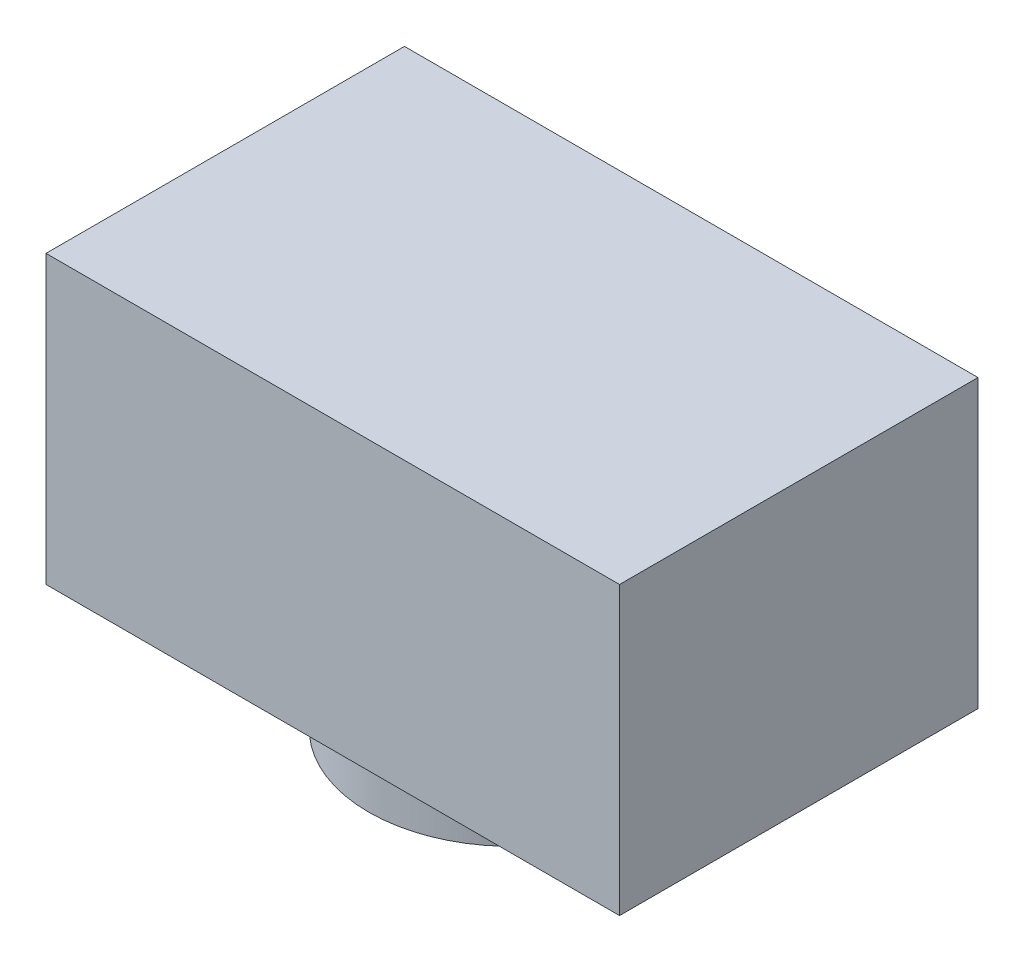
ISO-10303-21;
HEADER;
FILE_DESCRIPTION(('STEP AP214'),'2;1');
FILE_NAME('part.step','',(''),(''),'','','');
FILE_SCHEMA(('AUTOMOTIVE_DESIGN { 1 0 10303 214 1 1 1 1 }'));
ENDSEC;
DATA;
#1=APPLICATION_CONTEXT('core data for automotive mechanical design processes');
#2=APPLICATION_PROTOCOL_DEFINITION('international standard','automotive_design',2000,#1);
#3=PRODUCT_CONTEXT('',#1,'mechanical');
#4=PRODUCT('Part','Part','',(#3));
#5=PRODUCT_RELATED_PRODUCT_CATEGORY('part','',(#4));
#6=PRODUCT_DEFINITION_FORMATION('','',#4);
#7=PRODUCT_DEFINITION_CONTEXT('part definition',#1,'design');
#8=PRODUCT_DEFINITION('design','',#6,#7);
#9=PRODUCT_DEFINITION_SHAPE('','',#8);
#10=(LENGTH_UNIT() NAMED_UNIT(*) SI_UNIT(.MILLI.,.METRE.));
#11=(NAMED_UNIT(*) PLANE_ANGLE_UNIT() SI_UNIT($,.RADIAN.));
#12=(NAMED_UNIT(*) SI_UNIT($,.STERADIAN.) SOLID_ANGLE_UNIT());
#13=UNCERTAINTY_MEASURE_WITH_UNIT(LENGTH_MEASURE(1.E-05),#10,'distance_accuracy_value','');
#14=(GEOMETRIC_REPRESENTATION_CONTEXT(3) GLOBAL_UNCERTAINTY_ASSIGNED_CONTEXT((#13)) GLOBAL_UNIT_ASSIGNED_CONTEXT((#10,
#11,#12)) REPRESENTATION_CONTEXT('',''));
#15=CARTESIAN_POINT('',(0.,0.,0.));
#16=DIRECTION('',(0.,0.,1.));
#17=DIRECTION('',(1.,0.,0.));
#18=AXIS2_PLACEMENT_3D('',#15,#16,#17);
#19=CARTESIAN_POINT('',(-4.,2.,5.));
#20=DIRECTION('',(1.,0.,0.));
#21=DIRECTION('',(0.,0.,-1.));
#22=AXIS2_PLACEMENT_3D('',#19,#20,#21);
#23=PLANE('',#22);
#24=DIRECTION('',(0.,-1.,0.));
#25=VECTOR('',#24,1.);
#26=CARTESIAN_POINT('',(-4.,2.,0.));
#27=LINE('',#26,#25);
#28=CARTESIAN_POINT('',(-4.,2.,0.));
#29=VERTEX_POINT('',#28);
#30=CARTESIAN_POINT('',(-4.,-2.,0.));
#31=VERTEX_POINT('',#30);
#32=EDGE_CURVE('E100',#29,#31,#27,.T.);
#33=ORIENTED_EDGE('',*,*,#32,.T.);
#34=DIRECTION('',(0.,0.,-1.));
#35=VECTOR('',#34,1.);
#36=CARTESIAN_POINT('',(-4.,-2.,5.));
#37=LINE('',#36,#35);
#38=CARTESIAN_POINT('',(-4.,-2.,5.));
#39=VERTEX_POINT('',#38);
#40=EDGE_CURVE('E37',#39,#31,#37,.T.);
#41=ORIENTED_EDGE('',*,*,#40,.F.);
#42=DIRECTION('',(0.,-1.,0.));
#43=VECTOR('',#42,1.);
#44=CARTESIAN_POINT('',(-4.,2.,5.));
#45=LINE('',#44,#43);
#46=CARTESIAN_POINT('',(-4.,2.,5.));
#47=VERTEX_POINT('',#46);
#48=EDGE_CURVE('E85',#47,#39,#45,.T.);
#49=ORIENTED_EDGE('',*,*,#48,.F.);
#50=DIRECTION('',(0.,0.,-1.));
#51=VECTOR('',#50,1.);
#52=CARTESIAN_POINT('',(-4.,2.,5.));
#53=LINE('',#52,#51);
#54=EDGE_CURVE('E51',#47,#29,#53,.T.);
#55=ORIENTED_EDGE('',*,*,#54,.T.);
#56=EDGE_LOOP('',(#33,#41,#49,#55));
#57=FACE_BOUND('',#56,.T.);
#58=ADVANCED_FACE('F34',(#57),#23,.F.);
#59=CARTESIAN_POINT('',(-4.,-2.,5.));
#60=DIRECTION('',(0.,1.,0.));
#61=DIRECTION('',(0.,0.,1.));
#62=AXIS2_PLACEMENT_3D('',#59,#60,#61);
#63=PLANE('',#62);
#64=CARTESIAN_POINT('',(0.,-2.,2.5));
#65=DIRECTION('',(0.,-1.,0.));
#66=DIRECTION('',(0.,0.,-1.));
#67=AXIS2_PLACEMENT_3D('',#64,#65,#66);
#68=CIRCLE('',#67,2.);
#69=CARTESIAN_POINT('',(0.,-2.,0.5));
#70=VERTEX_POINT('',#69);
#71=EDGE_CURVE('E11',#70,#70,#68,.T.);
#72=ORIENTED_EDGE('',*,*,#71,.F.);
#73=EDGE_LOOP('',(#72));
#74=FACE_BOUND('',#73,.T.);
#75=DIRECTION('',(1.,0.,0.));
#76=VECTOR('',#75,1.);
#77=CARTESIAN_POINT('',(-4.,-2.,0.));
#78=LINE('',#77,#76);
#79=CARTESIAN_POINT('',(4.,-2.,0.));
#80=VERTEX_POINT('',#79);
#81=EDGE_CURVE('E91',#31,#80,#78,.T.);
#82=ORIENTED_EDGE('',*,*,#81,.T.);
#83=DIRECTION('',(0.,0.,-1.));
#84=VECTOR('',#83,1.);
#85=CARTESIAN_POINT('',(4.,-2.,5.));
#86=LINE('',#85,#84);
#87=CARTESIAN_POINT('',(4.,-2.,5.));
#88=VERTEX_POINT('',#87);
#89=EDGE_CURVE('E89',#88,#80,#86,.T.);
#90=ORIENTED_EDGE('',*,*,#89,.F.);
#91=DIRECTION('',(1.,0.,0.));
#92=VECTOR('',#91,1.);
#93=CARTESIAN_POINT('',(-4.,-2.,5.));
#94=LINE('',#93,#92);
#95=EDGE_CURVE('E77',#39,#88,#94,.T.);
#96=ORIENTED_EDGE('',*,*,#95,.F.);
#97=ORIENTED_EDGE('',*,*,#40,.T.);
#98=EDGE_LOOP('',(#82,#90,#96,#97));
#99=FACE_BOUND('',#98,.T.);
#100=ADVANCED_FACE('F90',(#74,#99),#63,.F.);
#101=CARTESIAN_POINT('',(4.,2.,5.));
#102=DIRECTION('',(1.,0.,0.));
#103=DIRECTION('',(0.,0.,-1.));
#104=AXIS2_PLACEMENT_3D('',#101,#102,#103);
#105=PLANE('',#104);
#106=DIRECTION('',(0.,-1.,0.));
#107=VECTOR('',#106,1.);
#108=CARTESIAN_POINT('',(4.,2.,0.));
#109=LINE('',#108,#107);
#110=CARTESIAN_POINT('',(4.,2.,0.));
#111=VERTEX_POINT('',#110);
#112=EDGE_CURVE('E104',#111,#80,#109,.T.);
#113=ORIENTED_EDGE('',*,*,#112,.F.);
#114=DIRECTION('',(0.,0.,-1.));
#115=VECTOR('',#114,1.);
#116=CARTESIAN_POINT('',(4.,2.,5.));
#117=LINE('',#116,#115);
#118=CARTESIAN_POINT('',(4.,2.,5.));
#119=VERTEX_POINT('',#118);
#120=EDGE_CURVE('E65',#119,#111,#117,.T.);
#121=ORIENTED_EDGE('',*,*,#120,.F.);
#122=DIRECTION('',(0.,-1.,0.));
#123=VECTOR('',#122,1.);
#124=CARTESIAN_POINT('',(4.,2.,5.));
#125=LINE('',#124,#123);
#126=EDGE_CURVE('E84',#119,#88,#125,.T.);
#127=ORIENTED_EDGE('',*,*,#126,.T.);
#128=ORIENTED_EDGE('',*,*,#89,.T.);
#129=EDGE_LOOP('',(#113,#121,#127,#128));
#130=FACE_BOUND('',#129,.T.);
#131=ADVANCED_FACE('F94',(#130),#105,.T.);
#132=CARTESIAN_POINT('',(-4.,2.,5.));
#133=DIRECTION('',(0.,1.,0.));
#134=DIRECTION('',(-1.,0.,0.));
#135=AXIS2_PLACEMENT_3D('',#132,#133,#134);
#136=PLANE('',#135);
#137=DIRECTION('',(1.,0.,0.));
#138=VECTOR('',#137,1.);
#139=CARTESIAN_POINT('',(-4.,2.,0.));
#140=LINE('',#139,#138);
#141=EDGE_CURVE('E106',#29,#111,#140,.T.);
#142=ORIENTED_EDGE('',*,*,#141,.F.);
#143=ORIENTED_EDGE('',*,*,#54,.F.);
#144=DIRECTION('',(1.,0.,0.));
#145=VECTOR('',#144,1.);
#146=CARTESIAN_POINT('',(-4.,2.,5.));
#147=LINE('',#146,#145);
#148=EDGE_CURVE('E95',#47,#119,#147,.T.);
#149=ORIENTED_EDGE('',*,*,#148,.T.);
#150=ORIENTED_EDGE('',*,*,#120,.T.);
#151=EDGE_LOOP('',(#142,#143,#149,#150));
#152=FACE_BOUND('',#151,.T.);
#153=ADVANCED_FACE('F147',(#152),#136,.T.);
#154=CARTESIAN_POINT('',(0.,0.,5.));
#155=DIRECTION('',(0.,0.,1.));
#156=DIRECTION('',(1.,0.,0.));
#157=AXIS2_PLACEMENT_3D('',#154,#155,#156);
#158=PLANE('',#157);
#159=ORIENTED_EDGE('',*,*,#48,.T.);
#160=ORIENTED_EDGE('',*,*,#95,.T.);
#161=ORIENTED_EDGE('',*,*,#126,.F.);
#162=ORIENTED_EDGE('',*,*,#148,.F.);
#163=EDGE_LOOP('',(#159,#160,#161,#162));
#164=FACE_BOUND('',#163,.T.);
#165=ADVANCED_FACE('F81',(#164),#158,.T.);
#166=CARTESIAN_POINT('',(0.,0.,0.));
#167=DIRECTION('',(0.,0.,1.));
#168=DIRECTION('',(1.,0.,0.));
#169=AXIS2_PLACEMENT_3D('',#166,#167,#168);
#170=PLANE('',#169);
#171=ORIENTED_EDGE('',*,*,#32,.F.);
#172=ORIENTED_EDGE('',*,*,#141,.T.);
#173=ORIENTED_EDGE('',*,*,#112,.T.);
#174=ORIENTED_EDGE('',*,*,#81,.F.);
#175=EDGE_LOOP('',(#171,#172,#173,#174));
#176=FACE_BOUND('',#175,.T.);
#177=ADVANCED_FACE('F138',(#176),#170,.F.);
#178=CARTESIAN_POINT('',(0.,-3.,2.5));
#179=DIRECTION('',(0.,1.,0.));
#180=DIRECTION('',(0.,0.,1.));
#181=AXIS2_PLACEMENT_3D('',#178,#179,#180);
#182=CYLINDRICAL_SURFACE('',#181,2.);
#183=CARTESIAN_POINT('',(0.,-3.,2.5));
#184=DIRECTION('',(0.,-1.,0.));
#185=DIRECTION('',(0.,0.,-1.));
#186=AXIS2_PLACEMENT_3D('',#183,#184,#185);
#187=CIRCLE('',#186,2.);
#188=CARTESIAN_POINT('',(0.,-3.,0.5));
#189=VERTEX_POINT('',#188);
#190=EDGE_CURVE('E102',#189,#189,#187,.T.);
#191=ORIENTED_EDGE('',*,*,#190,.F.);
#192=EDGE_LOOP('',(#191));
#193=FACE_BOUND('',#192,.T.);
#194=ORIENTED_EDGE('',*,*,#71,.T.);
#195=EDGE_LOOP('',(#194));
#196=FACE_BOUND('',#195,.T.);
#197=ADVANCED_FACE('F132',(#193,#196),#182,.T.);
#198=CARTESIAN_POINT('',(0.,-3.,2.5));
#199=DIRECTION('',(0.,-1.,0.));
#200=DIRECTION('',(0.,0.,-1.));
#201=AXIS2_PLACEMENT_3D('',#198,#199,#200);
#202=PLANE('',#201);
#203=CARTESIAN_POINT('',(0.,-3.,2.5));
#204=DIRECTION('',(0.,-1.,0.));
#205=DIRECTION('',(0.,0.,-1.));
#206=AXIS2_PLACEMENT_3D('',#203,#204,#205);
#207=CIRCLE('',#206,1.);
#208=CARTESIAN_POINT('',(0.,-3.,1.5));
#209=VERTEX_POINT('',#208);
#210=EDGE_CURVE('E115',#209,#209,#207,.T.);
#211=ORIENTED_EDGE('',*,*,#210,.F.);
#212=EDGE_LOOP('',(#211));
#213=FACE_BOUND('',#212,.T.);
#214=ORIENTED_EDGE('',*,*,#190,.T.);
#215=EDGE_LOOP('',(#214));
#216=FACE_BOUND('',#215,.T.);
#217=ADVANCED_FACE('F126',(#213,#216),#202,.T.);
#218=CARTESIAN_POINT('',(0.,-2.75,2.5));
#219=DIRECTION('',(0.,-1.,0.));
#220=DIRECTION('',(0.,0.,-1.));
#221=AXIS2_PLACEMENT_3D('',#218,#219,#220);
#222=CYLINDRICAL_SURFACE('',#221,1.);
#223=CARTESIAN_POINT('',(0.,-2.75,2.5));
#224=DIRECTION('',(0.,-1.,0.));
#225=DIRECTION('',(0.,0.,-1.));
#226=AXIS2_PLACEMENT_3D('',#223,#224,#225);
#227=CIRCLE('',#226,1.);
#228=CARTESIAN_POINT('',(0.,-2.75,1.5));
#229=VERTEX_POINT('',#228);
#230=EDGE_CURVE('E114',#229,#229,#227,.T.);
#231=ORIENTED_EDGE('',*,*,#230,.F.);
#232=EDGE_LOOP('',(#231));
#233=FACE_BOUND('',#232,.T.);
#234=ORIENTED_EDGE('',*,*,#210,.T.);
#235=EDGE_LOOP('',(#234));
#236=FACE_BOUND('',#235,.T.);
#237=ADVANCED_FACE('F123',(#233,#236),#222,.F.);
#238=CARTESIAN_POINT('',(0.,-2.75,2.5));
#239=DIRECTION('',(0.,-1.,0.));
#240=DIRECTION('',(0.,0.,-1.));
#241=AXIS2_PLACEMENT_3D('',#238,#239,#240);
#242=PLANE('',#241);
#243=ORIENTED_EDGE('',*,*,#230,.T.);
#244=EDGE_LOOP('',(#243));
#245=FACE_BOUND('',#244,.T.);
#246=ADVANCED_FACE('F121',(#245),#242,.T.);
#247=CLOSED_SHELL('',(#58,#100,#131,#153,#165,#177,#197,#217,#237,#246));
#248=MANIFOLD_SOLID_BREP('B2',#247);
#249=ADVANCED_BREP_SHAPE_REPRESENTATION('',(#18,#248),#14);
#250=SHAPE_DEFINITION_REPRESENTATION(#9,#249);
ENDSEC;
END-ISO-10303-21;
